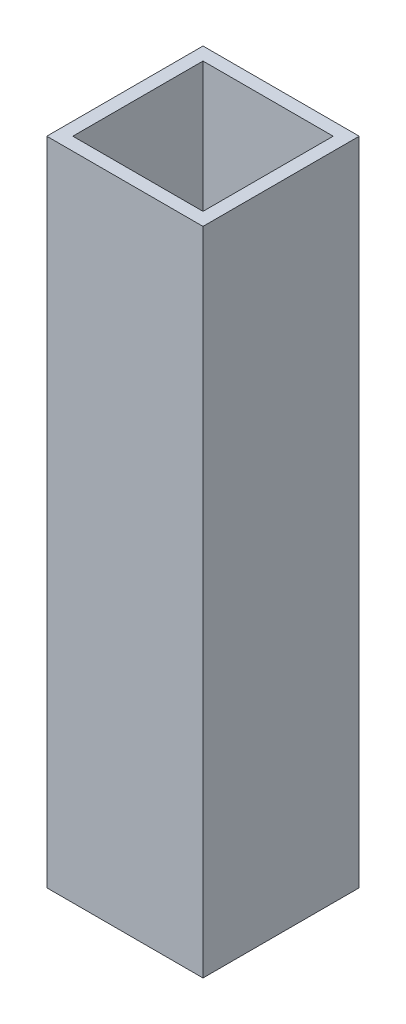
ISO-10303-21;
HEADER;
FILE_DESCRIPTION(('STEP AP214'),'2;1');
FILE_NAME('part.step','',(''),(''),'','','');
FILE_SCHEMA(('AUTOMOTIVE_DESIGN { 1 0 10303 214 1 1 1 1 }'));
ENDSEC;
DATA;
#1=APPLICATION_CONTEXT('core data for automotive mechanical design processes');
#2=APPLICATION_PROTOCOL_DEFINITION('international standard','automotive_design',2000,#1);
#3=PRODUCT_CONTEXT('',#1,'mechanical');
#4=PRODUCT('Part','Part','',(#3));
#5=PRODUCT_RELATED_PRODUCT_CATEGORY('part','',(#4));
#6=PRODUCT_DEFINITION_FORMATION('','',#4);
#7=PRODUCT_DEFINITION_CONTEXT('part definition',#1,'design');
#8=PRODUCT_DEFINITION('design','',#6,#7);
#9=PRODUCT_DEFINITION_SHAPE('','',#8);
#10=(LENGTH_UNIT() NAMED_UNIT(*) SI_UNIT(.MILLI.,.METRE.));
#11=(NAMED_UNIT(*) PLANE_ANGLE_UNIT() SI_UNIT($,.RADIAN.));
#12=(NAMED_UNIT(*) SI_UNIT($,.STERADIAN.) SOLID_ANGLE_UNIT());
#13=UNCERTAINTY_MEASURE_WITH_UNIT(LENGTH_MEASURE(1.E-05),#10,'distance_accuracy_value','');
#14=(GEOMETRIC_REPRESENTATION_CONTEXT(3) GLOBAL_UNCERTAINTY_ASSIGNED_CONTEXT((#13)) GLOBAL_UNIT_ASSIGNED_CONTEXT((#10,
#11,#12)) REPRESENTATION_CONTEXT('',''));
#15=CARTESIAN_POINT('',(0.,0.,0.));
#16=DIRECTION('',(0.,0.,1.));
#17=DIRECTION('',(1.,0.,0.));
#18=AXIS2_PLACEMENT_3D('',#15,#16,#17);
#19=CARTESIAN_POINT('',(-31.7391304347827,49.7826086956523,-24.));
#20=DIRECTION('',(-1.,0.,0.));
#21=DIRECTION('',(0.,-1.,0.));
#22=AXIS2_PLACEMENT_3D('',#19,#20,#21);
#23=PLANE('',#22);
#24=DIRECTION('',(0.,-1.,0.));
#25=VECTOR('',#24,1.);
#26=CARTESIAN_POINT('',(-31.7391304347827,49.7826086956523,0.));
#27=LINE('',#26,#25);
#28=CARTESIAN_POINT('',(-31.7391304347827,49.7826086956523,0.));
#29=VERTEX_POINT('',#28);
#30=CARTESIAN_POINT('',(-31.7391304347827,-50.2173913043477,0.));
#31=VERTEX_POINT('',#30);
#32=EDGE_CURVE('E134',#29,#31,#27,.T.);
#33=ORIENTED_EDGE('',*,*,#32,.F.);
#34=DIRECTION('',(0.,0.,1.));
#35=VECTOR('',#34,1.);
#36=CARTESIAN_POINT('',(-31.7391304347827,49.7826086956523,-24.));
#37=LINE('',#36,#35);
#38=CARTESIAN_POINT('',(-31.7391304347827,49.7826086956523,-24.));
#39=VERTEX_POINT('',#38);
#40=EDGE_CURVE('E171',#39,#29,#37,.T.);
#41=ORIENTED_EDGE('',*,*,#40,.F.);
#42=DIRECTION('',(0.,-1.,0.));
#43=VECTOR('',#42,1.);
#44=CARTESIAN_POINT('',(-31.7391304347827,49.7826086956523,-24.));
#45=LINE('',#44,#43);
#46=CARTESIAN_POINT('',(-31.7391304347827,-50.2173913043477,-24.));
#47=VERTEX_POINT('',#46);
#48=EDGE_CURVE('E139',#39,#47,#45,.T.);
#49=ORIENTED_EDGE('',*,*,#48,.T.);
#50=DIRECTION('',(0.,0.,1.));
#51=VECTOR('',#50,1.);
#52=CARTESIAN_POINT('',(-31.7391304347827,-50.2173913043477,-24.));
#53=LINE('',#52,#51);
#54=EDGE_CURVE('E156',#47,#31,#53,.T.);
#55=ORIENTED_EDGE('',*,*,#54,.T.);
#56=EDGE_LOOP('',(#33,#41,#49,#55));
#57=FACE_BOUND('',#56,.T.);
#58=ADVANCED_FACE('F39',(#57),#23,.T.);
#59=CARTESIAN_POINT('',(-31.7391304347827,49.7826086956523,-24.));
#60=DIRECTION('',(0.,1.,0.));
#61=DIRECTION('',(0.,0.,1.));
#62=AXIS2_PLACEMENT_3D('',#59,#60,#61);
#63=PLANE('',#62);
#64=DIRECTION('',(0.,0.,1.));
#65=VECTOR('',#64,1.);
#66=CARTESIAN_POINT('',(-29.7391304347827,49.7826086956523,-22.));
#67=LINE('',#66,#65);
#68=CARTESIAN_POINT('',(-29.7391304347827,49.7826086956523,-22.));
#69=VERTEX_POINT('',#68);
#70=CARTESIAN_POINT('',(-29.7391304347827,49.7826086956523,-2.));
#71=VERTEX_POINT('',#70);
#72=EDGE_CURVE('E54',#69,#71,#67,.T.);
#73=ORIENTED_EDGE('',*,*,#72,.F.);
#74=DIRECTION('',(-1.,0.,0.));
#75=VECTOR('',#74,1.);
#76=CARTESIAN_POINT('',(-9.73913043478266,49.7826086956523,-22.));
#77=LINE('',#76,#75);
#78=CARTESIAN_POINT('',(-9.73913043478266,49.7826086956523,-22.));
#79=VERTEX_POINT('',#78);
#80=EDGE_CURVE('E124',#79,#69,#77,.T.);
#81=ORIENTED_EDGE('',*,*,#80,.F.);
#82=DIRECTION('',(0.,0.,-1.));
#83=VECTOR('',#82,1.);
#84=CARTESIAN_POINT('',(-9.73913043478266,49.7826086956523,-2.));
#85=LINE('',#84,#83);
#86=CARTESIAN_POINT('',(-9.73913043478266,49.7826086956523,-2.));
#87=VERTEX_POINT('',#86);
#88=EDGE_CURVE('E106',#87,#79,#85,.T.);
#89=ORIENTED_EDGE('',*,*,#88,.F.);
#90=DIRECTION('',(1.,0.,0.));
#91=VECTOR('',#90,1.);
#92=CARTESIAN_POINT('',(-29.7391304347827,49.7826086956523,-2.));
#93=LINE('',#92,#91);
#94=EDGE_CURVE('E116',#71,#87,#93,.T.);
#95=ORIENTED_EDGE('',*,*,#94,.F.);
#96=EDGE_LOOP('',(#73,#81,#89,#95));
#97=FACE_BOUND('',#96,.T.);
#98=DIRECTION('',(-1.,0.,0.));
#99=VECTOR('',#98,1.);
#100=CARTESIAN_POINT('',(-31.7391304347827,49.7826086956523,0.));
#101=LINE('',#100,#99);
#102=CARTESIAN_POINT('',(-7.73913043478267,49.7826086956523,0.));
#103=VERTEX_POINT('',#102);
#104=EDGE_CURVE('E144',#103,#29,#101,.T.);
#105=ORIENTED_EDGE('',*,*,#104,.F.);
#106=DIRECTION('',(0.,0.,1.));
#107=VECTOR('',#106,1.);
#108=CARTESIAN_POINT('',(-7.73913043478267,49.7826086956523,-24.));
#109=LINE('',#108,#107);
#110=CARTESIAN_POINT('',(-7.73913043478267,49.7826086956523,-24.));
#111=VERTEX_POINT('',#110);
#112=EDGE_CURVE('E175',#111,#103,#109,.T.);
#113=ORIENTED_EDGE('',*,*,#112,.F.);
#114=DIRECTION('',(-1.,0.,0.));
#115=VECTOR('',#114,1.);
#116=CARTESIAN_POINT('',(-31.7391304347827,49.7826086956523,-24.));
#117=LINE('',#116,#115);
#118=EDGE_CURVE('E152',#111,#39,#117,.T.);
#119=ORIENTED_EDGE('',*,*,#118,.T.);
#120=ORIENTED_EDGE('',*,*,#40,.T.);
#121=EDGE_LOOP('',(#105,#113,#119,#120));
#122=FACE_BOUND('',#121,.T.);
#123=ADVANCED_FACE('F121',(#97,#122),#63,.T.);
#124=CARTESIAN_POINT('',(-7.73913043478267,49.7826086956523,-24.));
#125=DIRECTION('',(1.,0.,0.));
#126=DIRECTION('',(0.,1.,0.));
#127=AXIS2_PLACEMENT_3D('',#124,#125,#126);
#128=PLANE('',#127);
#129=DIRECTION('',(0.,1.,0.));
#130=VECTOR('',#129,1.);
#131=CARTESIAN_POINT('',(-7.73913043478267,49.7826086956523,0.));
#132=LINE('',#131,#130);
#133=CARTESIAN_POINT('',(-7.73913043478265,-50.2173913043477,0.));
#134=VERTEX_POINT('',#133);
#135=EDGE_CURVE('E164',#134,#103,#132,.T.);
#136=ORIENTED_EDGE('',*,*,#135,.F.);
#137=DIRECTION('',(0.,0.,1.));
#138=VECTOR('',#137,1.);
#139=CARTESIAN_POINT('',(-7.73913043478265,-50.2173913043477,-24.));
#140=LINE('',#139,#138);
#141=CARTESIAN_POINT('',(-7.73913043478265,-50.2173913043477,-24.));
#142=VERTEX_POINT('',#141);
#143=EDGE_CURVE('E178',#142,#134,#140,.T.);
#144=ORIENTED_EDGE('',*,*,#143,.F.);
#145=DIRECTION('',(0.,1.,0.));
#146=VECTOR('',#145,1.);
#147=CARTESIAN_POINT('',(-7.73913043478267,49.7826086956523,-24.));
#148=LINE('',#147,#146);
#149=EDGE_CURVE('E148',#142,#111,#148,.T.);
#150=ORIENTED_EDGE('',*,*,#149,.T.);
#151=ORIENTED_EDGE('',*,*,#112,.T.);
#152=EDGE_LOOP('',(#136,#144,#150,#151));
#153=FACE_BOUND('',#152,.T.);
#154=ADVANCED_FACE('F215',(#153),#128,.T.);
#155=CARTESIAN_POINT('',(-31.7391304347827,-50.2173913043477,-24.));
#156=DIRECTION('',(0.,-1.,0.));
#157=DIRECTION('',(0.,0.,-1.));
#158=AXIS2_PLACEMENT_3D('',#155,#156,#157);
#159=PLANE('',#158);
#160=DIRECTION('',(0.,0.,-1.));
#161=VECTOR('',#160,1.);
#162=CARTESIAN_POINT('',(-29.7391304347827,-50.2173913043477,-24.));
#163=LINE('',#162,#161);
#164=CARTESIAN_POINT('',(-29.7391304347827,-50.2173913043477,-2.));
#165=VERTEX_POINT('',#164);
#166=CARTESIAN_POINT('',(-29.7391304347827,-50.2173913043477,-22.));
#167=VERTEX_POINT('',#166);
#168=EDGE_CURVE('E11',#165,#167,#163,.T.);
#169=ORIENTED_EDGE('',*,*,#168,.F.);
#170=DIRECTION('',(-1.,0.,0.));
#171=VECTOR('',#170,1.);
#172=CARTESIAN_POINT('',(-31.7391304347827,-50.2173913043477,-2.));
#173=LINE('',#172,#171);
#174=CARTESIAN_POINT('',(-9.73913043478267,-50.2173913043477,-2.));
#175=VERTEX_POINT('',#174);
#176=EDGE_CURVE('E174',#175,#165,#173,.T.);
#177=ORIENTED_EDGE('',*,*,#176,.F.);
#178=DIRECTION('',(0.,0.,1.));
#179=VECTOR('',#178,1.);
#180=CARTESIAN_POINT('',(-9.73913043478267,-50.2173913043477,-24.));
#181=LINE('',#180,#179);
#182=CARTESIAN_POINT('',(-9.73913043478266,-50.2173913043477,-22.));
#183=VERTEX_POINT('',#182);
#184=EDGE_CURVE('E109',#183,#175,#181,.T.);
#185=ORIENTED_EDGE('',*,*,#184,.F.);
#186=DIRECTION('',(1.,0.,0.));
#187=VECTOR('',#186,1.);
#188=CARTESIAN_POINT('',(-31.7391304347827,-50.2173913043477,-22.));
#189=LINE('',#188,#187);
#190=EDGE_CURVE('E47',#167,#183,#189,.T.);
#191=ORIENTED_EDGE('',*,*,#190,.F.);
#192=EDGE_LOOP('',(#169,#177,#185,#191));
#193=FACE_BOUND('',#192,.T.);
#194=DIRECTION('',(1.,0.,0.));
#195=VECTOR('',#194,1.);
#196=CARTESIAN_POINT('',(-31.7391304347827,-50.2173913043477,0.));
#197=LINE('',#196,#195);
#198=EDGE_CURVE('E160',#31,#134,#197,.T.);
#199=ORIENTED_EDGE('',*,*,#198,.F.);
#200=ORIENTED_EDGE('',*,*,#54,.F.);
#201=DIRECTION('',(1.,0.,0.));
#202=VECTOR('',#201,1.);
#203=CARTESIAN_POINT('',(-31.7391304347827,-50.2173913043477,-24.));
#204=LINE('',#203,#202);
#205=EDGE_CURVE('E143',#47,#142,#204,.T.);
#206=ORIENTED_EDGE('',*,*,#205,.T.);
#207=ORIENTED_EDGE('',*,*,#143,.T.);
#208=EDGE_LOOP('',(#199,#200,#206,#207));
#209=FACE_BOUND('',#208,.T.);
#210=ADVANCED_FACE('F193',(#193,#209),#159,.T.);
#211=CARTESIAN_POINT('',(0.,0.,-24.));
#212=DIRECTION('',(0.,0.,1.));
#213=DIRECTION('',(1.,0.,0.));
#214=AXIS2_PLACEMENT_3D('',#211,#212,#213);
#215=PLANE('',#214);
#216=ORIENTED_EDGE('',*,*,#48,.F.);
#217=ORIENTED_EDGE('',*,*,#118,.F.);
#218=ORIENTED_EDGE('',*,*,#149,.F.);
#219=ORIENTED_EDGE('',*,*,#205,.F.);
#220=EDGE_LOOP('',(#216,#217,#218,#219));
#221=FACE_BOUND('',#220,.T.);
#222=ADVANCED_FACE('F205',(#221),#215,.F.);
#223=CARTESIAN_POINT('',(0.,0.,0.));
#224=DIRECTION('',(0.,0.,1.));
#225=DIRECTION('',(1.,0.,0.));
#226=AXIS2_PLACEMENT_3D('',#223,#224,#225);
#227=PLANE('',#226);
#228=ORIENTED_EDGE('',*,*,#32,.T.);
#229=ORIENTED_EDGE('',*,*,#198,.T.);
#230=ORIENTED_EDGE('',*,*,#135,.T.);
#231=ORIENTED_EDGE('',*,*,#104,.T.);
#232=EDGE_LOOP('',(#228,#229,#230,#231));
#233=FACE_BOUND('',#232,.T.);
#234=ADVANCED_FACE('F198',(#233),#227,.T.);
#235=CARTESIAN_POINT('',(-29.7391304347827,-150.217391304348,-22.));
#236=DIRECTION('',(-1.,0.,0.));
#237=DIRECTION('',(0.,0.,1.));
#238=AXIS2_PLACEMENT_3D('',#235,#236,#237);
#239=PLANE('',#238);
#240=ORIENTED_EDGE('',*,*,#168,.T.);
#241=DIRECTION('',(0.,1.,0.));
#242=VECTOR('',#241,1.);
#243=CARTESIAN_POINT('',(-29.7391304347827,-150.217391304348,-22.));
#244=LINE('',#243,#242);
#245=EDGE_CURVE('E131',#167,#69,#244,.T.);
#246=ORIENTED_EDGE('',*,*,#245,.T.);
#247=ORIENTED_EDGE('',*,*,#72,.T.);
#248=DIRECTION('',(0.,1.,0.));
#249=VECTOR('',#248,1.);
#250=CARTESIAN_POINT('',(-29.7391304347827,-150.217391304348,-2.));
#251=LINE('',#250,#249);
#252=EDGE_CURVE('E113',#165,#71,#251,.T.);
#253=ORIENTED_EDGE('',*,*,#252,.F.);
#254=EDGE_LOOP('',(#240,#246,#247,#253));
#255=FACE_BOUND('',#254,.T.);
#256=ADVANCED_FACE('F195',(#255),#239,.F.);
#257=CARTESIAN_POINT('',(-9.73913043478266,-150.217391304348,-22.));
#258=DIRECTION('',(0.,0.,-1.));
#259=DIRECTION('',(-1.,0.,0.));
#260=AXIS2_PLACEMENT_3D('',#257,#258,#259);
#261=PLANE('',#260);
#262=ORIENTED_EDGE('',*,*,#190,.T.);
#263=DIRECTION('',(0.,1.,0.));
#264=VECTOR('',#263,1.);
#265=CARTESIAN_POINT('',(-9.73913043478266,-150.217391304348,-22.));
#266=LINE('',#265,#264);
#267=EDGE_CURVE('E112',#183,#79,#266,.T.);
#268=ORIENTED_EDGE('',*,*,#267,.T.);
#269=ORIENTED_EDGE('',*,*,#80,.T.);
#270=ORIENTED_EDGE('',*,*,#245,.F.);
#271=EDGE_LOOP('',(#262,#268,#269,#270));
#272=FACE_BOUND('',#271,.T.);
#273=ADVANCED_FACE('F190',(#272),#261,.F.);
#274=CARTESIAN_POINT('',(-9.73913043478266,-150.217391304348,-2.));
#275=DIRECTION('',(1.,0.,0.));
#276=DIRECTION('',(0.,0.,-1.));
#277=AXIS2_PLACEMENT_3D('',#274,#275,#276);
#278=PLANE('',#277);
#279=ORIENTED_EDGE('',*,*,#184,.T.);
#280=DIRECTION('',(0.,1.,0.));
#281=VECTOR('',#280,1.);
#282=CARTESIAN_POINT('',(-9.73913043478266,-150.217391304348,-2.));
#283=LINE('',#282,#281);
#284=EDGE_CURVE('E62',#175,#87,#283,.T.);
#285=ORIENTED_EDGE('',*,*,#284,.T.);
#286=ORIENTED_EDGE('',*,*,#88,.T.);
#287=ORIENTED_EDGE('',*,*,#267,.F.);
#288=EDGE_LOOP('',(#279,#285,#286,#287));
#289=FACE_BOUND('',#288,.T.);
#290=ADVANCED_FACE('F103',(#289),#278,.F.);
#291=CARTESIAN_POINT('',(-29.7391304347827,-150.217391304348,-2.));
#292=DIRECTION('',(0.,0.,1.));
#293=DIRECTION('',(1.,0.,0.));
#294=AXIS2_PLACEMENT_3D('',#291,#292,#293);
#295=PLANE('',#294);
#296=ORIENTED_EDGE('',*,*,#176,.T.);
#297=ORIENTED_EDGE('',*,*,#252,.T.);
#298=ORIENTED_EDGE('',*,*,#94,.T.);
#299=ORIENTED_EDGE('',*,*,#284,.F.);
#300=EDGE_LOOP('',(#296,#297,#298,#299));
#301=FACE_BOUND('',#300,.T.);
#302=ADVANCED_FACE('F117',(#301),#295,.F.);
#303=CLOSED_SHELL('',(#58,#123,#154,#210,#222,#234,#256,#273,#290,#302));
#304=MANIFOLD_SOLID_BREP('B2',#303);
#305=ADVANCED_BREP_SHAPE_REPRESENTATION('',(#18,#304),#14);
#306=SHAPE_DEFINITION_REPRESENTATION(#9,#305);
ENDSEC;
END-ISO-10303-21;
